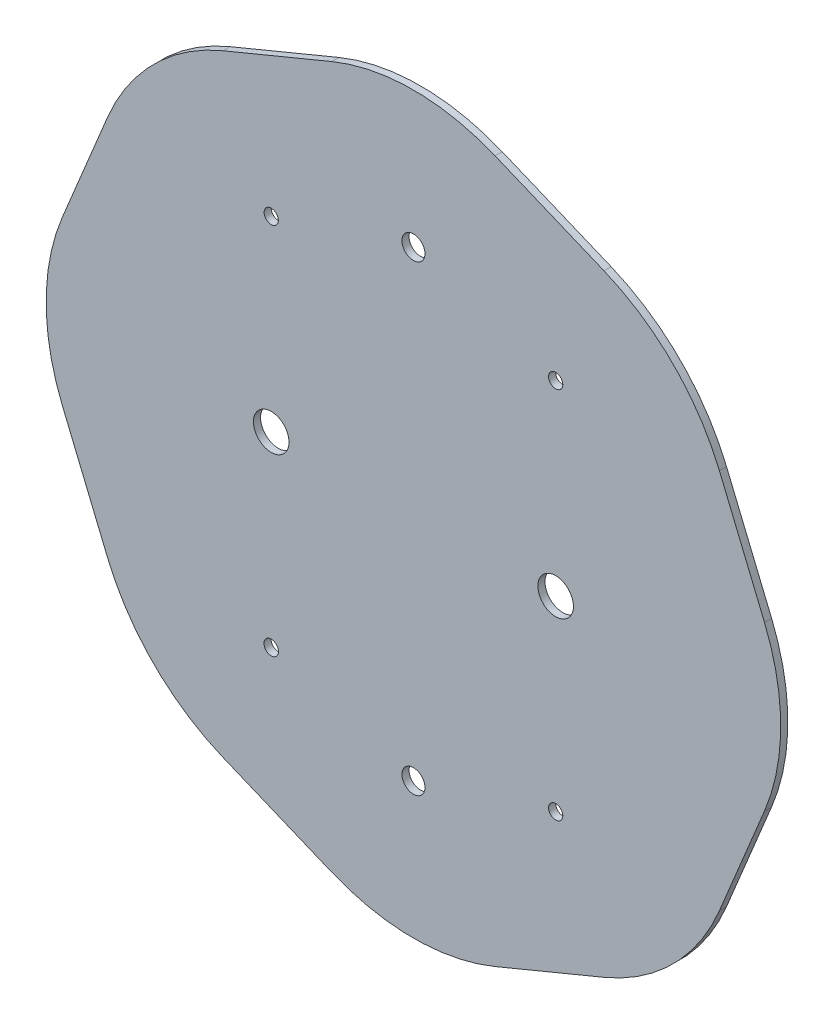
ISO-10303-21;
HEADER;
FILE_DESCRIPTION(('STEP AP214'),'2;1');
FILE_NAME('part.step','',(''),(''),'','','');
FILE_SCHEMA(('AUTOMOTIVE_DESIGN { 1 0 10303 214 1 1 1 1 }'));
ENDSEC;
DATA;
#1=APPLICATION_CONTEXT('core data for automotive mechanical design processes');
#2=APPLICATION_PROTOCOL_DEFINITION('international standard','automotive_design',2000,#1);
#3=PRODUCT_CONTEXT('',#1,'mechanical');
#4=PRODUCT('Part','Part','',(#3));
#5=PRODUCT_RELATED_PRODUCT_CATEGORY('part','',(#4));
#6=PRODUCT_DEFINITION_FORMATION('','',#4);
#7=PRODUCT_DEFINITION_CONTEXT('part definition',#1,'design');
#8=PRODUCT_DEFINITION('design','',#6,#7);
#9=PRODUCT_DEFINITION_SHAPE('','',#8);
#10=(LENGTH_UNIT() NAMED_UNIT(*) SI_UNIT(.MILLI.,.METRE.));
#11=(NAMED_UNIT(*) PLANE_ANGLE_UNIT() SI_UNIT($,.RADIAN.));
#12=(NAMED_UNIT(*) SI_UNIT($,.STERADIAN.) SOLID_ANGLE_UNIT());
#13=UNCERTAINTY_MEASURE_WITH_UNIT(LENGTH_MEASURE(1.E-05),#10,'distance_accuracy_value','');
#14=(GEOMETRIC_REPRESENTATION_CONTEXT(3) GLOBAL_UNCERTAINTY_ASSIGNED_CONTEXT((#13)) GLOBAL_UNIT_ASSIGNED_CONTEXT((#10,
#11,#12)) REPRESENTATION_CONTEXT('',''));
#15=CARTESIAN_POINT('',(0.,0.,0.));
#16=DIRECTION('',(0.,0.,1.));
#17=DIRECTION('',(1.,0.,0.));
#18=AXIS2_PLACEMENT_3D('',#15,#16,#17);
#19=CARTESIAN_POINT('',(-3.06146745892072,3.06146745892071,0.2));
#20=DIRECTION('',(0.,0.,1.));
#21=DIRECTION('',(1.,0.,0.));
#22=AXIS2_PLACEMENT_3D('',#19,#20,#21);
#23=PLANE('',#22);
#24=CARTESIAN_POINT('',(4.,-5.25,0.2));
#25=DIRECTION('',(0.,0.,-1.));
#26=DIRECTION('',(-1.,0.,0.));
#27=AXIS2_PLACEMENT_3D('',#24,#25,#26);
#28=CIRCLE('',#27,0.2);
#29=CARTESIAN_POINT('',(3.8,-5.25,0.2));
#30=VERTEX_POINT('',#29);
#31=EDGE_CURVE('E351',#30,#30,#28,.T.);
#32=ORIENTED_EDGE('',*,*,#31,.T.);
#33=EDGE_LOOP('',(#32));
#34=FACE_BOUND('',#33,.T.);
#35=CARTESIAN_POINT('',(0.,-6.5,0.2));
#36=DIRECTION('',(0.,0.,-1.));
#37=DIRECTION('',(-1.,0.,0.));
#38=AXIS2_PLACEMENT_3D('',#35,#36,#37);
#39=CIRCLE('',#38,0.323929716117766);
#40=CARTESIAN_POINT('',(-0.323929716117766,-6.5,0.2));
#41=VERTEX_POINT('',#40);
#42=EDGE_CURVE('E355',#41,#41,#39,.T.);
#43=ORIENTED_EDGE('',*,*,#42,.T.);
#44=EDGE_LOOP('',(#43));
#45=FACE_BOUND('',#44,.T.);
#46=CARTESIAN_POINT('',(-4.,-5.25,0.2));
#47=DIRECTION('',(0.,0.,-1.));
#48=DIRECTION('',(-1.,0.,0.));
#49=AXIS2_PLACEMENT_3D('',#46,#47,#48);
#50=CIRCLE('',#49,0.203589936638274);
#51=CARTESIAN_POINT('',(-4.20358993663827,-5.25,0.2));
#52=VERTEX_POINT('',#51);
#53=EDGE_CURVE('E363',#52,#52,#50,.T.);
#54=ORIENTED_EDGE('',*,*,#53,.T.);
#55=EDGE_LOOP('',(#54));
#56=FACE_BOUND('',#55,.T.);
#57=CARTESIAN_POINT('',(-4.,0.,0.2));
#58=DIRECTION('',(0.,0.,-1.));
#59=DIRECTION('',(-1.,0.,0.));
#60=AXIS2_PLACEMENT_3D('',#57,#58,#59);
#61=CIRCLE('',#60,0.5);
#62=CARTESIAN_POINT('',(-4.5,0.,0.2));
#63=VERTEX_POINT('',#62);
#64=EDGE_CURVE('E368',#63,#63,#61,.T.);
#65=ORIENTED_EDGE('',*,*,#64,.T.);
#66=EDGE_LOOP('',(#65));
#67=FACE_BOUND('',#66,.T.);
#68=CARTESIAN_POINT('',(-3.06146745892072,3.06146745892071,0.2));
#69=DIRECTION('',(0.,0.,1.));
#70=DIRECTION('',(1.,0.,0.));
#71=AXIS2_PLACEMENT_3D('',#68,#69,#70);
#72=CIRCLE('',#71,6.);
#73=CARTESIAN_POINT('',(-5.35756805311127,8.60474465398843,0.2));
#74=VERTEX_POINT('',#73);
#75=CARTESIAN_POINT('',(-8.60474465398844,5.35756805311124,0.2));
#76=VERTEX_POINT('',#75);
#77=EDGE_CURVE('E210',#74,#76,#72,.T.);
#78=ORIENTED_EDGE('',*,*,#77,.T.);
#79=DIRECTION('',(-0.382683432365088,-0.923879532511287,0.));
#80=VECTOR('',#79,1.);
#81=CARTESIAN_POINT('',(-8.60474465398844,5.35756805311124,0.2));
#82=LINE('',#81,#80);
#83=CARTESIAN_POINT('',(-9.8728459962373,2.29610059419052,0.2));
#84=VERTEX_POINT('',#83);
#85=EDGE_CURVE('E118',#76,#84,#82,.T.);
#86=ORIENTED_EDGE('',*,*,#85,.T.);
#87=CARTESIAN_POINT('',(-4.32956880116957,0.,0.2));
#88=DIRECTION('',(0.,0.,1.));
#89=DIRECTION('',(1.,0.,0.));
#90=AXIS2_PLACEMENT_3D('',#87,#88,#89);
#91=CIRCLE('',#90,6.);
#92=CARTESIAN_POINT('',(-9.87284599623729,-2.29610059419055,0.2));
#93=VERTEX_POINT('',#92);
#94=EDGE_CURVE('E249',#84,#93,#91,.T.);
#95=ORIENTED_EDGE('',*,*,#94,.T.);
#96=DIRECTION('',(0.38268343236509,-0.923879532511286,0.));
#97=VECTOR('',#96,1.);
#98=CARTESIAN_POINT('',(-9.87284599623729,-2.29610059419055,0.2));
#99=LINE('',#98,#97);
#100=CARTESIAN_POINT('',(-8.60474465398843,-5.35756805311127,0.2));
#101=VERTEX_POINT('',#100);
#102=EDGE_CURVE('E268',#93,#101,#99,.T.);
#103=ORIENTED_EDGE('',*,*,#102,.T.);
#104=CARTESIAN_POINT('',(-3.06146745892071,-3.06146745892072,0.2));
#105=DIRECTION('',(0.,0.,1.));
#106=DIRECTION('',(1.,0.,0.));
#107=AXIS2_PLACEMENT_3D('',#104,#105,#106);
#108=CIRCLE('',#107,6.);
#109=CARTESIAN_POINT('',(-5.35756805311124,-8.60474465398845,0.2));
#110=VERTEX_POINT('',#109);
#111=EDGE_CURVE('E265',#101,#110,#108,.T.);
#112=ORIENTED_EDGE('',*,*,#111,.T.);
#113=DIRECTION('',(0.923879532511287,-0.382683432365088,0.));
#114=VECTOR('',#113,1.);
#115=CARTESIAN_POINT('',(-5.35756805311124,-8.60474465398845,0.2));
#116=LINE('',#115,#114);
#117=CARTESIAN_POINT('',(-2.29610059419053,-9.8728459962373,0.2));
#118=VERTEX_POINT('',#117);
#119=EDGE_CURVE('E267',#110,#118,#116,.T.);
#120=ORIENTED_EDGE('',*,*,#119,.T.);
#121=CARTESIAN_POINT('',(0.,-4.32956880116957,0.2));
#122=DIRECTION('',(0.,0.,1.));
#123=DIRECTION('',(1.,0.,0.));
#124=AXIS2_PLACEMENT_3D('',#121,#122,#123);
#125=CIRCLE('',#124,6.);
#126=CARTESIAN_POINT('',(2.29610059419055,-9.87284599623729,0.2));
#127=VERTEX_POINT('',#126);
#128=EDGE_CURVE('E270',#118,#127,#125,.T.);
#129=ORIENTED_EDGE('',*,*,#128,.T.);
#130=DIRECTION('',(0.923879532511287,0.38268343236509,0.));
#131=VECTOR('',#130,1.);
#132=CARTESIAN_POINT('',(2.29610059419055,-9.87284599623729,0.2));
#133=LINE('',#132,#131);
#134=CARTESIAN_POINT('',(5.35756805311126,-8.60474465398843,0.2));
#135=VERTEX_POINT('',#134);
#136=EDGE_CURVE('E276',#127,#135,#133,.T.);
#137=ORIENTED_EDGE('',*,*,#136,.T.);
#138=CARTESIAN_POINT('',(3.06146745892072,-3.06146745892071,0.2));
#139=DIRECTION('',(0.,0.,1.));
#140=DIRECTION('',(1.,0.,0.));
#141=AXIS2_PLACEMENT_3D('',#138,#139,#140);
#142=CIRCLE('',#141,6.);
#143=CARTESIAN_POINT('',(8.60474465398844,-5.35756805311125,0.2));
#144=VERTEX_POINT('',#143);
#145=EDGE_CURVE('E278',#135,#144,#142,.T.);
#146=ORIENTED_EDGE('',*,*,#145,.T.);
#147=DIRECTION('',(0.382683432365088,0.923879532511288,0.));
#148=VECTOR('',#147,1.);
#149=CARTESIAN_POINT('',(8.60474465398844,-5.35756805311125,0.2));
#150=LINE('',#149,#148);
#151=CARTESIAN_POINT('',(9.8728459962373,-2.29610059419053,0.2));
#152=VERTEX_POINT('',#151);
#153=EDGE_CURVE('E280',#144,#152,#150,.T.);
#154=ORIENTED_EDGE('',*,*,#153,.T.);
#155=CARTESIAN_POINT('',(4.32956880116958,0.,0.2));
#156=DIRECTION('',(0.,0.,1.));
#157=DIRECTION('',(1.,0.,0.));
#158=AXIS2_PLACEMENT_3D('',#155,#156,#157);
#159=CIRCLE('',#158,6.);
#160=CARTESIAN_POINT('',(9.87284599623729,2.29610059419055,0.2));
#161=VERTEX_POINT('',#160);
#162=EDGE_CURVE('E282',#152,#161,#159,.T.);
#163=ORIENTED_EDGE('',*,*,#162,.T.);
#164=DIRECTION('',(-0.382683432365091,0.923879532511286,0.));
#165=VECTOR('',#164,1.);
#166=CARTESIAN_POINT('',(9.87284599623729,2.29610059419055,0.2));
#167=LINE('',#166,#165);
#168=CARTESIAN_POINT('',(8.60474465398843,5.35756805311126,0.2));
#169=VERTEX_POINT('',#168);
#170=EDGE_CURVE('E284',#161,#169,#167,.T.);
#171=ORIENTED_EDGE('',*,*,#170,.T.);
#172=CARTESIAN_POINT('',(3.06146745892072,3.06146745892072,0.2));
#173=DIRECTION('',(0.,0.,1.));
#174=DIRECTION('',(1.,0.,0.));
#175=AXIS2_PLACEMENT_3D('',#172,#173,#174);
#176=CIRCLE('',#175,6.);
#177=CARTESIAN_POINT('',(5.35756805311125,8.60474465398844,0.2));
#178=VERTEX_POINT('',#177);
#179=EDGE_CURVE('E161',#169,#178,#176,.T.);
#180=ORIENTED_EDGE('',*,*,#179,.T.);
#181=DIRECTION('',(-0.923879532511287,0.382683432365088,0.));
#182=VECTOR('',#181,1.);
#183=CARTESIAN_POINT('',(5.35756805311125,8.60474465398844,0.2));
#184=LINE('',#183,#182);
#185=CARTESIAN_POINT('',(2.29610059419052,9.8728459962373,0.2));
#186=VERTEX_POINT('',#185);
#187=EDGE_CURVE('E155',#178,#186,#184,.T.);
#188=ORIENTED_EDGE('',*,*,#187,.T.);
#189=CARTESIAN_POINT('',(0.,4.32956880116957,0.2));
#190=DIRECTION('',(0.,0.,1.));
#191=DIRECTION('',(-1.,0.,0.));
#192=AXIS2_PLACEMENT_3D('',#189,#190,#191);
#193=CIRCLE('',#192,6.);
#194=CARTESIAN_POINT('',(-2.29610059419055,9.87284599623729,0.2));
#195=VERTEX_POINT('',#194);
#196=EDGE_CURVE('E159',#186,#195,#193,.T.);
#197=ORIENTED_EDGE('',*,*,#196,.T.);
#198=DIRECTION('',(-0.923879532511287,-0.38268343236509,0.));
#199=VECTOR('',#198,1.);
#200=CARTESIAN_POINT('',(-2.29610059419055,9.87284599623729,0.2));
#201=LINE('',#200,#199);
#202=EDGE_CURVE('E51',#195,#74,#201,.T.);
#203=ORIENTED_EDGE('',*,*,#202,.T.);
#204=EDGE_LOOP('',(#78,#86,#95,#103,#112,#120,#129,#137,#146,#154,#163,#171,#180,#188,#197,#203));
#205=FACE_BOUND('',#204,.T.);
#206=CARTESIAN_POINT('',(-4.,5.25,0.2));
#207=DIRECTION('',(0.,0.,-1.));
#208=DIRECTION('',(-1.,0.,0.));
#209=AXIS2_PLACEMENT_3D('',#206,#207,#208);
#210=CIRCLE('',#209,0.200000000000001);
#211=CARTESIAN_POINT('',(-4.2,5.25,0.2));
#212=VERTEX_POINT('',#211);
#213=EDGE_CURVE('E183',#212,#212,#210,.T.);
#214=ORIENTED_EDGE('',*,*,#213,.T.);
#215=EDGE_LOOP('',(#214));
#216=FACE_BOUND('',#215,.T.);
#217=CARTESIAN_POINT('',(0.,6.5,0.2));
#218=DIRECTION('',(0.,0.,-1.));
#219=DIRECTION('',(-1.,0.,0.));
#220=AXIS2_PLACEMENT_3D('',#217,#218,#219);
#221=CIRCLE('',#220,0.323929716117766);
#222=CARTESIAN_POINT('',(-0.323929716117766,6.5,0.2));
#223=VERTEX_POINT('',#222);
#224=EDGE_CURVE('E386',#223,#223,#221,.T.);
#225=ORIENTED_EDGE('',*,*,#224,.T.);
#226=EDGE_LOOP('',(#225));
#227=FACE_BOUND('',#226,.T.);
#228=CARTESIAN_POINT('',(4.,5.25,0.2));
#229=DIRECTION('',(0.,0.,-1.));
#230=DIRECTION('',(-1.,0.,0.));
#231=AXIS2_PLACEMENT_3D('',#228,#229,#230);
#232=CIRCLE('',#231,0.200000000000001);
#233=CARTESIAN_POINT('',(3.8,5.25,0.2));
#234=VERTEX_POINT('',#233);
#235=EDGE_CURVE('E380',#234,#234,#232,.T.);
#236=ORIENTED_EDGE('',*,*,#235,.T.);
#237=EDGE_LOOP('',(#236));
#238=FACE_BOUND('',#237,.T.);
#239=CARTESIAN_POINT('',(4.,0.,0.2));
#240=DIRECTION('',(0.,0.,1.));
#241=DIRECTION('',(1.,0.,0.));
#242=AXIS2_PLACEMENT_3D('',#239,#240,#241);
#243=CIRCLE('',#242,0.5);
#244=CARTESIAN_POINT('',(4.5,0.,0.2));
#245=VERTEX_POINT('',#244);
#246=EDGE_CURVE('E374',#245,#245,#243,.T.);
#247=ORIENTED_EDGE('',*,*,#246,.F.);
#248=EDGE_LOOP('',(#247));
#249=FACE_BOUND('',#248,.T.);
#250=ADVANCED_FACE('F34',(#34,#45,#56,#67,#205,#216,#227,#238,#249),#23,.T.);
#251=CARTESIAN_POINT('',(-3.06146745892072,3.06146745892071,0.));
#252=DIRECTION('',(0.,0.,1.));
#253=DIRECTION('',(1.,0.,0.));
#254=AXIS2_PLACEMENT_3D('',#251,#252,#253);
#255=PLANE('',#254);
#256=CARTESIAN_POINT('',(4.,-5.25,0.));
#257=DIRECTION('',(0.,0.,-1.));
#258=DIRECTION('',(-1.,0.,0.));
#259=AXIS2_PLACEMENT_3D('',#256,#257,#258);
#260=CIRCLE('',#259,0.2);
#261=CARTESIAN_POINT('',(3.8,-5.25,0.));
#262=VERTEX_POINT('',#261);
#263=EDGE_CURVE('E354',#262,#262,#260,.T.);
#264=ORIENTED_EDGE('',*,*,#263,.F.);
#265=EDGE_LOOP('',(#264));
#266=FACE_BOUND('',#265,.T.);
#267=CARTESIAN_POINT('',(0.,-6.5,0.));
#268=DIRECTION('',(0.,0.,-1.));
#269=DIRECTION('',(-1.,0.,0.));
#270=AXIS2_PLACEMENT_3D('',#267,#268,#269);
#271=CIRCLE('',#270,0.323929716117766);
#272=CARTESIAN_POINT('',(-0.323929716117766,-6.5,0.));
#273=VERTEX_POINT('',#272);
#274=EDGE_CURVE('E358',#273,#273,#271,.T.);
#275=ORIENTED_EDGE('',*,*,#274,.F.);
#276=EDGE_LOOP('',(#275));
#277=FACE_BOUND('',#276,.T.);
#278=CARTESIAN_POINT('',(-4.,-5.25,0.));
#279=DIRECTION('',(0.,0.,-1.));
#280=DIRECTION('',(-1.,0.,0.));
#281=AXIS2_PLACEMENT_3D('',#278,#279,#280);
#282=CIRCLE('',#281,0.203589936638274);
#283=CARTESIAN_POINT('',(-4.20358993663827,-5.25,0.));
#284=VERTEX_POINT('',#283);
#285=EDGE_CURVE('E365',#284,#284,#282,.T.);
#286=ORIENTED_EDGE('',*,*,#285,.F.);
#287=EDGE_LOOP('',(#286));
#288=FACE_BOUND('',#287,.T.);
#289=CARTESIAN_POINT('',(-4.,0.,0.));
#290=DIRECTION('',(0.,0.,-1.));
#291=DIRECTION('',(-1.,0.,0.));
#292=AXIS2_PLACEMENT_3D('',#289,#290,#291);
#293=CIRCLE('',#292,0.5);
#294=CARTESIAN_POINT('',(-4.5,0.,0.));
#295=VERTEX_POINT('',#294);
#296=EDGE_CURVE('E371',#295,#295,#293,.T.);
#297=ORIENTED_EDGE('',*,*,#296,.F.);
#298=EDGE_LOOP('',(#297));
#299=FACE_BOUND('',#298,.T.);
#300=CARTESIAN_POINT('',(-3.06146745892072,3.06146745892071,0.));
#301=DIRECTION('',(0.,0.,1.));
#302=DIRECTION('',(1.,0.,0.));
#303=AXIS2_PLACEMENT_3D('',#300,#301,#302);
#304=CIRCLE('',#303,6.);
#305=CARTESIAN_POINT('',(-5.35756805311127,8.60474465398843,0.));
#306=VERTEX_POINT('',#305);
#307=CARTESIAN_POINT('',(-8.60474465398844,5.35756805311124,0.));
#308=VERTEX_POINT('',#307);
#309=EDGE_CURVE('E179',#306,#308,#304,.T.);
#310=ORIENTED_EDGE('',*,*,#309,.F.);
#311=DIRECTION('',(-0.923879532511287,-0.38268343236509,0.));
#312=VECTOR('',#311,1.);
#313=CARTESIAN_POINT('',(-2.29610059419055,9.87284599623729,0.));
#314=LINE('',#313,#312);
#315=CARTESIAN_POINT('',(-2.29610059419055,9.87284599623729,0.));
#316=VERTEX_POINT('',#315);
#317=EDGE_CURVE('E110',#316,#306,#314,.T.);
#318=ORIENTED_EDGE('',*,*,#317,.F.);
#319=CARTESIAN_POINT('',(0.,4.32956880116957,0.));
#320=DIRECTION('',(0.,0.,1.));
#321=DIRECTION('',(-1.,0.,0.));
#322=AXIS2_PLACEMENT_3D('',#319,#320,#321);
#323=CIRCLE('',#322,6.);
#324=CARTESIAN_POINT('',(2.29610059419052,9.8728459962373,0.));
#325=VERTEX_POINT('',#324);
#326=EDGE_CURVE('E104',#325,#316,#323,.T.);
#327=ORIENTED_EDGE('',*,*,#326,.F.);
#328=DIRECTION('',(-0.923879532511287,0.382683432365088,0.));
#329=VECTOR('',#328,1.);
#330=CARTESIAN_POINT('',(5.35756805311125,8.60474465398844,0.));
#331=LINE('',#330,#329);
#332=CARTESIAN_POINT('',(5.35756805311125,8.60474465398844,0.));
#333=VERTEX_POINT('',#332);
#334=EDGE_CURVE('E169',#333,#325,#331,.T.);
#335=ORIENTED_EDGE('',*,*,#334,.F.);
#336=CARTESIAN_POINT('',(3.06146745892072,3.06146745892072,0.));
#337=DIRECTION('',(0.,0.,1.));
#338=DIRECTION('',(1.,0.,0.));
#339=AXIS2_PLACEMENT_3D('',#336,#337,#338);
#340=CIRCLE('',#339,6.);
#341=CARTESIAN_POINT('',(8.60474465398843,5.35756805311126,0.));
#342=VERTEX_POINT('',#341);
#343=EDGE_CURVE('E205',#342,#333,#340,.T.);
#344=ORIENTED_EDGE('',*,*,#343,.F.);
#345=DIRECTION('',(-0.382683432365091,0.923879532511286,0.));
#346=VECTOR('',#345,1.);
#347=CARTESIAN_POINT('',(9.87284599623729,2.29610059419055,0.));
#348=LINE('',#347,#346);
#349=CARTESIAN_POINT('',(9.87284599623729,2.29610059419055,0.));
#350=VERTEX_POINT('',#349);
#351=EDGE_CURVE('E203',#350,#342,#348,.T.);
#352=ORIENTED_EDGE('',*,*,#351,.F.);
#353=CARTESIAN_POINT('',(4.32956880116958,0.,0.));
#354=DIRECTION('',(0.,0.,1.));
#355=DIRECTION('',(1.,0.,0.));
#356=AXIS2_PLACEMENT_3D('',#353,#354,#355);
#357=CIRCLE('',#356,6.);
#358=CARTESIAN_POINT('',(9.8728459962373,-2.29610059419053,0.));
#359=VERTEX_POINT('',#358);
#360=EDGE_CURVE('E201',#359,#350,#357,.T.);
#361=ORIENTED_EDGE('',*,*,#360,.F.);
#362=DIRECTION('',(0.382683432365088,0.923879532511288,0.));
#363=VECTOR('',#362,1.);
#364=CARTESIAN_POINT('',(8.60474465398844,-5.35756805311125,0.));
#365=LINE('',#364,#363);
#366=CARTESIAN_POINT('',(8.60474465398844,-5.35756805311125,0.));
#367=VERTEX_POINT('',#366);
#368=EDGE_CURVE('E199',#367,#359,#365,.T.);
#369=ORIENTED_EDGE('',*,*,#368,.F.);
#370=CARTESIAN_POINT('',(3.06146745892072,-3.06146745892071,0.));
#371=DIRECTION('',(0.,0.,1.));
#372=DIRECTION('',(1.,0.,0.));
#373=AXIS2_PLACEMENT_3D('',#370,#371,#372);
#374=CIRCLE('',#373,6.);
#375=CARTESIAN_POINT('',(5.35756805311126,-8.60474465398843,0.));
#376=VERTEX_POINT('',#375);
#377=EDGE_CURVE('E197',#376,#367,#374,.T.);
#378=ORIENTED_EDGE('',*,*,#377,.F.);
#379=DIRECTION('',(0.923879532511287,0.38268343236509,0.));
#380=VECTOR('',#379,1.);
#381=CARTESIAN_POINT('',(2.29610059419055,-9.87284599623729,0.));
#382=LINE('',#381,#380);
#383=CARTESIAN_POINT('',(2.29610059419055,-9.87284599623729,0.));
#384=VERTEX_POINT('',#383);
#385=EDGE_CURVE('E195',#384,#376,#382,.T.);
#386=ORIENTED_EDGE('',*,*,#385,.F.);
#387=CARTESIAN_POINT('',(0.,-4.32956880116957,0.));
#388=DIRECTION('',(0.,0.,1.));
#389=DIRECTION('',(1.,0.,0.));
#390=AXIS2_PLACEMENT_3D('',#387,#388,#389);
#391=CIRCLE('',#390,6.);
#392=CARTESIAN_POINT('',(-2.29610059419053,-9.8728459962373,0.));
#393=VERTEX_POINT('',#392);
#394=EDGE_CURVE('E193',#393,#384,#391,.T.);
#395=ORIENTED_EDGE('',*,*,#394,.F.);
#396=DIRECTION('',(0.923879532511287,-0.382683432365088,0.));
#397=VECTOR('',#396,1.);
#398=CARTESIAN_POINT('',(-5.35756805311124,-8.60474465398845,0.));
#399=LINE('',#398,#397);
#400=CARTESIAN_POINT('',(-5.35756805311124,-8.60474465398845,0.));
#401=VERTEX_POINT('',#400);
#402=EDGE_CURVE('E191',#401,#393,#399,.T.);
#403=ORIENTED_EDGE('',*,*,#402,.F.);
#404=CARTESIAN_POINT('',(-3.06146745892071,-3.06146745892072,0.));
#405=DIRECTION('',(0.,0.,1.));
#406=DIRECTION('',(1.,0.,0.));
#407=AXIS2_PLACEMENT_3D('',#404,#405,#406);
#408=CIRCLE('',#407,6.);
#409=CARTESIAN_POINT('',(-8.60474465398843,-5.35756805311127,0.));
#410=VERTEX_POINT('',#409);
#411=EDGE_CURVE('E189',#410,#401,#408,.T.);
#412=ORIENTED_EDGE('',*,*,#411,.F.);
#413=DIRECTION('',(0.38268343236509,-0.923879532511286,0.));
#414=VECTOR('',#413,1.);
#415=CARTESIAN_POINT('',(-9.87284599623729,-2.29610059419055,0.));
#416=LINE('',#415,#414);
#417=CARTESIAN_POINT('',(-9.87284599623729,-2.29610059419055,0.));
#418=VERTEX_POINT('',#417);
#419=EDGE_CURVE('E187',#418,#410,#416,.T.);
#420=ORIENTED_EDGE('',*,*,#419,.F.);
#421=CARTESIAN_POINT('',(-4.32956880116957,0.,0.));
#422=DIRECTION('',(0.,0.,1.));
#423=DIRECTION('',(1.,0.,0.));
#424=AXIS2_PLACEMENT_3D('',#421,#422,#423);
#425=CIRCLE('',#424,6.);
#426=CARTESIAN_POINT('',(-9.8728459962373,2.29610059419052,0.));
#427=VERTEX_POINT('',#426);
#428=EDGE_CURVE('E185',#427,#418,#425,.T.);
#429=ORIENTED_EDGE('',*,*,#428,.F.);
#430=DIRECTION('',(-0.382683432365088,-0.923879532511287,0.));
#431=VECTOR('',#430,1.);
#432=CARTESIAN_POINT('',(-8.60474465398844,5.35756805311124,0.));
#433=LINE('',#432,#431);
#434=EDGE_CURVE('E182',#308,#427,#433,.T.);
#435=ORIENTED_EDGE('',*,*,#434,.F.);
#436=EDGE_LOOP('',(#310,#318,#327,#335,#344,#352,#361,#369,#378,#386,#395,#403,#412,#420,#429,#435));
#437=FACE_BOUND('',#436,.T.);
#438=CARTESIAN_POINT('',(-4.,5.25,0.));
#439=DIRECTION('',(0.,0.,-1.));
#440=DIRECTION('',(-1.,0.,0.));
#441=AXIS2_PLACEMENT_3D('',#438,#439,#440);
#442=CIRCLE('',#441,0.200000000000001);
#443=CARTESIAN_POINT('',(-4.2,5.25,0.));
#444=VERTEX_POINT('',#443);
#445=EDGE_CURVE('E392',#444,#444,#442,.T.);
#446=ORIENTED_EDGE('',*,*,#445,.F.);
#447=EDGE_LOOP('',(#446));
#448=FACE_BOUND('',#447,.T.);
#449=CARTESIAN_POINT('',(0.,6.5,0.));
#450=DIRECTION('',(0.,0.,-1.));
#451=DIRECTION('',(-1.,0.,0.));
#452=AXIS2_PLACEMENT_3D('',#449,#450,#451);
#453=CIRCLE('',#452,0.323929716117766);
#454=CARTESIAN_POINT('',(-0.323929716117766,6.5,0.));
#455=VERTEX_POINT('',#454);
#456=EDGE_CURVE('E389',#455,#455,#453,.T.);
#457=ORIENTED_EDGE('',*,*,#456,.F.);
#458=EDGE_LOOP('',(#457));
#459=FACE_BOUND('',#458,.T.);
#460=CARTESIAN_POINT('',(4.,5.25,0.));
#461=DIRECTION('',(0.,0.,-1.));
#462=DIRECTION('',(-1.,0.,0.));
#463=AXIS2_PLACEMENT_3D('',#460,#461,#462);
#464=CIRCLE('',#463,0.200000000000001);
#465=CARTESIAN_POINT('',(3.8,5.25,0.));
#466=VERTEX_POINT('',#465);
#467=EDGE_CURVE('E383',#466,#466,#464,.T.);
#468=ORIENTED_EDGE('',*,*,#467,.F.);
#469=EDGE_LOOP('',(#468));
#470=FACE_BOUND('',#469,.T.);
#471=CARTESIAN_POINT('',(4.,0.,0.));
#472=DIRECTION('',(0.,0.,1.));
#473=DIRECTION('',(1.,0.,0.));
#474=AXIS2_PLACEMENT_3D('',#471,#472,#473);
#475=CIRCLE('',#474,0.5);
#476=CARTESIAN_POINT('',(4.5,0.,0.));
#477=VERTEX_POINT('',#476);
#478=EDGE_CURVE('E377',#477,#477,#475,.T.);
#479=ORIENTED_EDGE('',*,*,#478,.T.);
#480=EDGE_LOOP('',(#479));
#481=FACE_BOUND('',#480,.T.);
#482=ADVANCED_FACE('F253',(#266,#277,#288,#299,#437,#448,#459,#470,#481),#255,.F.);
#483=CARTESIAN_POINT('',(-3.06146745892072,3.06146745892071,0.2));
#484=DIRECTION('',(0.,0.,-1.));
#485=DIRECTION('',(-1.,0.,0.));
#486=AXIS2_PLACEMENT_3D('',#483,#484,#485);
#487=CYLINDRICAL_SURFACE('',#486,6.);
#488=ORIENTED_EDGE('',*,*,#309,.T.);
#489=DIRECTION('',(0.,0.,-1.));
#490=VECTOR('',#489,1.);
#491=CARTESIAN_POINT('',(-8.60474465398844,5.35756805311124,0.2));
#492=LINE('',#491,#490);
#493=EDGE_CURVE('E11',#76,#308,#492,.T.);
#494=ORIENTED_EDGE('',*,*,#493,.F.);
#495=ORIENTED_EDGE('',*,*,#77,.F.);
#496=DIRECTION('',(0.,0.,-1.));
#497=VECTOR('',#496,1.);
#498=CARTESIAN_POINT('',(-5.35756805311127,8.60474465398843,0.2));
#499=LINE('',#498,#497);
#500=EDGE_CURVE('E175',#74,#306,#499,.T.);
#501=ORIENTED_EDGE('',*,*,#500,.T.);
#502=EDGE_LOOP('',(#488,#494,#495,#501));
#503=FACE_BOUND('',#502,.T.);
#504=ADVANCED_FACE('F36',(#503),#487,.T.);
#505=CARTESIAN_POINT('',(-8.60474465398844,5.35756805311124,0.2));
#506=DIRECTION('',(0.923879532511287,-0.382683432365088,0.));
#507=DIRECTION('',(0.382683432365088,0.923879532511287,0.));
#508=AXIS2_PLACEMENT_3D('',#505,#506,#507);
#509=PLANE('',#508);
#510=ORIENTED_EDGE('',*,*,#434,.T.);
#511=DIRECTION('',(0.,0.,-1.));
#512=VECTOR('',#511,1.);
#513=CARTESIAN_POINT('',(-9.8728459962373,2.29610059419052,0.2));
#514=LINE('',#513,#512);
#515=EDGE_CURVE('E43',#84,#427,#514,.T.);
#516=ORIENTED_EDGE('',*,*,#515,.F.);
#517=ORIENTED_EDGE('',*,*,#85,.F.);
#518=ORIENTED_EDGE('',*,*,#493,.T.);
#519=EDGE_LOOP('',(#510,#516,#517,#518));
#520=FACE_BOUND('',#519,.T.);
#521=ADVANCED_FACE('F590',(#520),#509,.F.);
#522=CARTESIAN_POINT('',(-4.32956880116957,0.,0.2));
#523=DIRECTION('',(0.,0.,-1.));
#524=DIRECTION('',(-1.,0.,0.));
#525=AXIS2_PLACEMENT_3D('',#522,#523,#524);
#526=CYLINDRICAL_SURFACE('',#525,6.);
#527=ORIENTED_EDGE('',*,*,#428,.T.);
#528=DIRECTION('',(0.,0.,-1.));
#529=VECTOR('',#528,1.);
#530=CARTESIAN_POINT('',(-9.87284599623729,-2.29610059419055,0.2));
#531=LINE('',#530,#529);
#532=EDGE_CURVE('E241',#93,#418,#531,.T.);
#533=ORIENTED_EDGE('',*,*,#532,.F.);
#534=ORIENTED_EDGE('',*,*,#94,.F.);
#535=ORIENTED_EDGE('',*,*,#515,.T.);
#536=EDGE_LOOP('',(#527,#533,#534,#535));
#537=FACE_BOUND('',#536,.T.);
#538=ADVANCED_FACE('F247',(#537),#526,.T.);
#539=CARTESIAN_POINT('',(-9.87284599623729,-2.29610059419055,0.2));
#540=DIRECTION('',(0.923879532511287,0.38268343236509,0.));
#541=DIRECTION('',(-0.38268343236509,0.923879532511287,0.));
#542=AXIS2_PLACEMENT_3D('',#539,#540,#541);
#543=PLANE('',#542);
#544=ORIENTED_EDGE('',*,*,#419,.T.);
#545=DIRECTION('',(0.,0.,-1.));
#546=VECTOR('',#545,1.);
#547=CARTESIAN_POINT('',(-8.60474465398843,-5.35756805311127,0.2));
#548=LINE('',#547,#546);
#549=EDGE_CURVE('E238',#101,#410,#548,.T.);
#550=ORIENTED_EDGE('',*,*,#549,.F.);
#551=ORIENTED_EDGE('',*,*,#102,.F.);
#552=ORIENTED_EDGE('',*,*,#532,.T.);
#553=EDGE_LOOP('',(#544,#550,#551,#552));
#554=FACE_BOUND('',#553,.T.);
#555=ADVANCED_FACE('F259',(#554),#543,.F.);
#556=CARTESIAN_POINT('',(-3.06146745892071,-3.06146745892072,0.2));
#557=DIRECTION('',(0.,0.,-1.));
#558=DIRECTION('',(-1.,0.,0.));
#559=AXIS2_PLACEMENT_3D('',#556,#557,#558);
#560=CYLINDRICAL_SURFACE('',#559,6.);
#561=ORIENTED_EDGE('',*,*,#411,.T.);
#562=DIRECTION('',(0.,0.,-1.));
#563=VECTOR('',#562,1.);
#564=CARTESIAN_POINT('',(-5.35756805311124,-8.60474465398845,0.2));
#565=LINE('',#564,#563);
#566=EDGE_CURVE('E235',#110,#401,#565,.T.);
#567=ORIENTED_EDGE('',*,*,#566,.F.);
#568=ORIENTED_EDGE('',*,*,#111,.F.);
#569=ORIENTED_EDGE('',*,*,#549,.T.);
#570=EDGE_LOOP('',(#561,#567,#568,#569));
#571=FACE_BOUND('',#570,.T.);
#572=ADVANCED_FACE('F263',(#571),#560,.T.);
#573=CARTESIAN_POINT('',(-5.35756805311124,-8.60474465398845,0.2));
#574=DIRECTION('',(0.382683432365088,0.923879532511287,0.));
#575=DIRECTION('',(-0.923879532511287,0.382683432365088,0.));
#576=AXIS2_PLACEMENT_3D('',#573,#574,#575);
#577=PLANE('',#576);
#578=ORIENTED_EDGE('',*,*,#402,.T.);
#579=DIRECTION('',(0.,0.,-1.));
#580=VECTOR('',#579,1.);
#581=CARTESIAN_POINT('',(-2.29610059419053,-9.8728459962373,0.2));
#582=LINE('',#581,#580);
#583=EDGE_CURVE('E232',#118,#393,#582,.T.);
#584=ORIENTED_EDGE('',*,*,#583,.F.);
#585=ORIENTED_EDGE('',*,*,#119,.F.);
#586=ORIENTED_EDGE('',*,*,#566,.T.);
#587=EDGE_LOOP('',(#578,#584,#585,#586));
#588=FACE_BOUND('',#587,.T.);
#589=ADVANCED_FACE('F555',(#588),#577,.F.);
#590=CARTESIAN_POINT('',(0.,-4.32956880116957,0.2));
#591=DIRECTION('',(0.,0.,-1.));
#592=DIRECTION('',(-1.,0.,0.));
#593=AXIS2_PLACEMENT_3D('',#590,#591,#592);
#594=CYLINDRICAL_SURFACE('',#593,6.);
#595=ORIENTED_EDGE('',*,*,#394,.T.);
#596=DIRECTION('',(0.,0.,-1.));
#597=VECTOR('',#596,1.);
#598=CARTESIAN_POINT('',(2.29610059419055,-9.87284599623729,0.2));
#599=LINE('',#598,#597);
#600=EDGE_CURVE('E229',#127,#384,#599,.T.);
#601=ORIENTED_EDGE('',*,*,#600,.F.);
#602=ORIENTED_EDGE('',*,*,#128,.F.);
#603=ORIENTED_EDGE('',*,*,#583,.T.);
#604=EDGE_LOOP('',(#595,#601,#602,#603));
#605=FACE_BOUND('',#604,.T.);
#606=ADVANCED_FACE('F545',(#605),#594,.T.);
#607=CARTESIAN_POINT('',(2.29610059419055,-9.87284599623729,0.2));
#608=DIRECTION('',(-0.38268343236509,0.923879532511287,0.));
#609=DIRECTION('',(-0.923879532511287,-0.38268343236509,0.));
#610=AXIS2_PLACEMENT_3D('',#607,#608,#609);
#611=PLANE('',#610);
#612=ORIENTED_EDGE('',*,*,#385,.T.);
#613=DIRECTION('',(0.,0.,-1.));
#614=VECTOR('',#613,1.);
#615=CARTESIAN_POINT('',(5.35756805311126,-8.60474465398843,0.2));
#616=LINE('',#615,#614);
#617=EDGE_CURVE('E226',#135,#376,#616,.T.);
#618=ORIENTED_EDGE('',*,*,#617,.F.);
#619=ORIENTED_EDGE('',*,*,#136,.F.);
#620=ORIENTED_EDGE('',*,*,#600,.T.);
#621=EDGE_LOOP('',(#612,#618,#619,#620));
#622=FACE_BOUND('',#621,.T.);
#623=ADVANCED_FACE('F535',(#622),#611,.F.);
#624=CARTESIAN_POINT('',(3.06146745892072,-3.06146745892071,0.2));
#625=DIRECTION('',(0.,0.,-1.));
#626=DIRECTION('',(-1.,0.,0.));
#627=AXIS2_PLACEMENT_3D('',#624,#625,#626);
#628=CYLINDRICAL_SURFACE('',#627,6.);
#629=ORIENTED_EDGE('',*,*,#377,.T.);
#630=DIRECTION('',(0.,0.,-1.));
#631=VECTOR('',#630,1.);
#632=CARTESIAN_POINT('',(8.60474465398844,-5.35756805311125,0.2));
#633=LINE('',#632,#631);
#634=EDGE_CURVE('E223',#144,#367,#633,.T.);
#635=ORIENTED_EDGE('',*,*,#634,.F.);
#636=ORIENTED_EDGE('',*,*,#145,.F.);
#637=ORIENTED_EDGE('',*,*,#617,.T.);
#638=EDGE_LOOP('',(#629,#635,#636,#637));
#639=FACE_BOUND('',#638,.T.);
#640=ADVANCED_FACE('F525',(#639),#628,.T.);
#641=CARTESIAN_POINT('',(8.60474465398844,-5.35756805311125,0.2));
#642=DIRECTION('',(-0.923879532511288,0.382683432365088,0.));
#643=DIRECTION('',(-0.382683432365088,-0.923879532511288,0.));
#644=AXIS2_PLACEMENT_3D('',#641,#642,#643);
#645=PLANE('',#644);
#646=ORIENTED_EDGE('',*,*,#368,.T.);
#647=DIRECTION('',(0.,0.,-1.));
#648=VECTOR('',#647,1.);
#649=CARTESIAN_POINT('',(9.8728459962373,-2.29610059419053,0.2));
#650=LINE('',#649,#648);
#651=EDGE_CURVE('E220',#152,#359,#650,.T.);
#652=ORIENTED_EDGE('',*,*,#651,.F.);
#653=ORIENTED_EDGE('',*,*,#153,.F.);
#654=ORIENTED_EDGE('',*,*,#634,.T.);
#655=EDGE_LOOP('',(#646,#652,#653,#654));
#656=FACE_BOUND('',#655,.T.);
#657=ADVANCED_FACE('F515',(#656),#645,.F.);
#658=CARTESIAN_POINT('',(4.32956880116958,0.,0.2));
#659=DIRECTION('',(0.,0.,-1.));
#660=DIRECTION('',(-1.,0.,0.));
#661=AXIS2_PLACEMENT_3D('',#658,#659,#660);
#662=CYLINDRICAL_SURFACE('',#661,6.);
#663=ORIENTED_EDGE('',*,*,#360,.T.);
#664=DIRECTION('',(0.,0.,-1.));
#665=VECTOR('',#664,1.);
#666=CARTESIAN_POINT('',(9.87284599623729,2.29610059419055,0.2));
#667=LINE('',#666,#665);
#668=EDGE_CURVE('E217',#161,#350,#667,.T.);
#669=ORIENTED_EDGE('',*,*,#668,.F.);
#670=ORIENTED_EDGE('',*,*,#162,.F.);
#671=ORIENTED_EDGE('',*,*,#651,.T.);
#672=EDGE_LOOP('',(#663,#669,#670,#671));
#673=FACE_BOUND('',#672,.T.);
#674=ADVANCED_FACE('F506',(#673),#662,.T.);
#675=CARTESIAN_POINT('',(9.87284599623729,2.29610059419055,0.2));
#676=DIRECTION('',(-0.923879532511286,-0.382683432365091,0.));
#677=DIRECTION('',(0.382683432365091,-0.923879532511286,0.));
#678=AXIS2_PLACEMENT_3D('',#675,#676,#677);
#679=PLANE('',#678);
#680=ORIENTED_EDGE('',*,*,#351,.T.);
#681=DIRECTION('',(0.,0.,-1.));
#682=VECTOR('',#681,1.);
#683=CARTESIAN_POINT('',(8.60474465398843,5.35756805311126,0.2));
#684=LINE('',#683,#682);
#685=EDGE_CURVE('E214',#169,#342,#684,.T.);
#686=ORIENTED_EDGE('',*,*,#685,.F.);
#687=ORIENTED_EDGE('',*,*,#170,.F.);
#688=ORIENTED_EDGE('',*,*,#668,.T.);
#689=EDGE_LOOP('',(#680,#686,#687,#688));
#690=FACE_BOUND('',#689,.T.);
#691=ADVANCED_FACE('F290',(#690),#679,.F.);
#692=CARTESIAN_POINT('',(3.06146745892072,3.06146745892072,0.2));
#693=DIRECTION('',(0.,0.,-1.));
#694=DIRECTION('',(-1.,0.,0.));
#695=AXIS2_PLACEMENT_3D('',#692,#693,#694);
#696=CYLINDRICAL_SURFACE('',#695,6.);
#697=ORIENTED_EDGE('',*,*,#343,.T.);
#698=DIRECTION('',(0.,0.,-1.));
#699=VECTOR('',#698,1.);
#700=CARTESIAN_POINT('',(5.35756805311125,8.60474465398844,0.2));
#701=LINE('',#700,#699);
#702=EDGE_CURVE('E170',#178,#333,#701,.T.);
#703=ORIENTED_EDGE('',*,*,#702,.F.);
#704=ORIENTED_EDGE('',*,*,#179,.F.);
#705=ORIENTED_EDGE('',*,*,#685,.T.);
#706=EDGE_LOOP('',(#697,#703,#704,#705));
#707=FACE_BOUND('',#706,.T.);
#708=ADVANCED_FACE('F294',(#707),#696,.T.);
#709=CARTESIAN_POINT('',(5.35756805311125,8.60474465398844,0.2));
#710=DIRECTION('',(-0.382683432365089,-0.923879532511287,0.));
#711=DIRECTION('',(0.923879532511287,-0.382683432365089,0.));
#712=AXIS2_PLACEMENT_3D('',#709,#710,#711);
#713=PLANE('',#712);
#714=ORIENTED_EDGE('',*,*,#334,.T.);
#715=DIRECTION('',(0.,0.,-1.));
#716=VECTOR('',#715,1.);
#717=CARTESIAN_POINT('',(2.29610059419052,9.8728459962373,0.2));
#718=LINE('',#717,#716);
#719=EDGE_CURVE('E166',#186,#325,#718,.T.);
#720=ORIENTED_EDGE('',*,*,#719,.F.);
#721=ORIENTED_EDGE('',*,*,#187,.F.);
#722=ORIENTED_EDGE('',*,*,#702,.T.);
#723=EDGE_LOOP('',(#714,#720,#721,#722));
#724=FACE_BOUND('',#723,.T.);
#725=ADVANCED_FACE('F167',(#724),#713,.F.);
#726=CARTESIAN_POINT('',(0.,4.32956880116957,0.2));
#727=DIRECTION('',(0.,0.,-1.));
#728=DIRECTION('',(-1.,0.,0.));
#729=AXIS2_PLACEMENT_3D('',#726,#727,#728);
#730=CYLINDRICAL_SURFACE('',#729,6.);
#731=ORIENTED_EDGE('',*,*,#326,.T.);
#732=DIRECTION('',(0.,0.,-1.));
#733=VECTOR('',#732,1.);
#734=CARTESIAN_POINT('',(-2.29610059419055,9.87284599623729,0.2));
#735=LINE('',#734,#733);
#736=EDGE_CURVE('E171',#195,#316,#735,.T.);
#737=ORIENTED_EDGE('',*,*,#736,.F.);
#738=ORIENTED_EDGE('',*,*,#196,.F.);
#739=ORIENTED_EDGE('',*,*,#719,.T.);
#740=EDGE_LOOP('',(#731,#737,#738,#739));
#741=FACE_BOUND('',#740,.T.);
#742=ADVANCED_FACE('F173',(#741),#730,.T.);
#743=CARTESIAN_POINT('',(-2.29610059419055,9.87284599623729,0.2));
#744=DIRECTION('',(0.38268343236509,-0.923879532511287,0.));
#745=DIRECTION('',(0.923879532511287,0.38268343236509,0.));
#746=AXIS2_PLACEMENT_3D('',#743,#744,#745);
#747=PLANE('',#746);
#748=ORIENTED_EDGE('',*,*,#317,.T.);
#749=ORIENTED_EDGE('',*,*,#500,.F.);
#750=ORIENTED_EDGE('',*,*,#202,.F.);
#751=ORIENTED_EDGE('',*,*,#736,.T.);
#752=EDGE_LOOP('',(#748,#749,#750,#751));
#753=FACE_BOUND('',#752,.T.);
#754=ADVANCED_FACE('F298',(#753),#747,.F.);
#755=CARTESIAN_POINT('',(-4.,5.25,0.2));
#756=DIRECTION('',(0.,0.,-1.));
#757=DIRECTION('',(-1.,0.,0.));
#758=AXIS2_PLACEMENT_3D('',#755,#756,#757);
#759=CYLINDRICAL_SURFACE('',#758,0.200000000000001);
#760=ORIENTED_EDGE('',*,*,#213,.F.);
#761=EDGE_LOOP('',(#760));
#762=FACE_BOUND('',#761,.T.);
#763=ORIENTED_EDGE('',*,*,#445,.T.);
#764=EDGE_LOOP('',(#763));
#765=FACE_BOUND('',#764,.T.);
#766=ADVANCED_FACE('F300',(#762,#765),#759,.F.);
#767=CARTESIAN_POINT('',(0.,6.5,0.2));
#768=DIRECTION('',(0.,0.,-1.));
#769=DIRECTION('',(-1.,0.,0.));
#770=AXIS2_PLACEMENT_3D('',#767,#768,#769);
#771=CYLINDRICAL_SURFACE('',#770,0.323929716117766);
#772=ORIENTED_EDGE('',*,*,#224,.F.);
#773=EDGE_LOOP('',(#772));
#774=FACE_BOUND('',#773,.T.);
#775=ORIENTED_EDGE('',*,*,#456,.T.);
#776=EDGE_LOOP('',(#775));
#777=FACE_BOUND('',#776,.T.);
#778=ADVANCED_FACE('F306',(#774,#777),#771,.F.);
#779=CARTESIAN_POINT('',(4.,5.25,0.2));
#780=DIRECTION('',(0.,0.,-1.));
#781=DIRECTION('',(-1.,0.,0.));
#782=AXIS2_PLACEMENT_3D('',#779,#780,#781);
#783=CYLINDRICAL_SURFACE('',#782,0.200000000000001);
#784=ORIENTED_EDGE('',*,*,#235,.F.);
#785=EDGE_LOOP('',(#784));
#786=FACE_BOUND('',#785,.T.);
#787=ORIENTED_EDGE('',*,*,#467,.T.);
#788=EDGE_LOOP('',(#787));
#789=FACE_BOUND('',#788,.T.);
#790=ADVANCED_FACE('F323',(#786,#789),#783,.F.);
#791=CARTESIAN_POINT('',(4.,0.,0.2));
#792=DIRECTION('',(0.,0.,-1.));
#793=DIRECTION('',(-1.,0.,0.));
#794=AXIS2_PLACEMENT_3D('',#791,#792,#793);
#795=CYLINDRICAL_SURFACE('',#794,0.5);
#796=ORIENTED_EDGE('',*,*,#246,.T.);
#797=EDGE_LOOP('',(#796));
#798=FACE_BOUND('',#797,.T.);
#799=ORIENTED_EDGE('',*,*,#478,.F.);
#800=EDGE_LOOP('',(#799));
#801=FACE_BOUND('',#800,.T.);
#802=ADVANCED_FACE('F327',(#798,#801),#795,.F.);
#803=CARTESIAN_POINT('',(-4.,0.,0.2));
#804=DIRECTION('',(0.,0.,-1.));
#805=DIRECTION('',(-1.,0.,0.));
#806=AXIS2_PLACEMENT_3D('',#803,#804,#805);
#807=CYLINDRICAL_SURFACE('',#806,0.5);
#808=ORIENTED_EDGE('',*,*,#64,.F.);
#809=EDGE_LOOP('',(#808));
#810=FACE_BOUND('',#809,.T.);
#811=ORIENTED_EDGE('',*,*,#296,.T.);
#812=EDGE_LOOP('',(#811));
#813=FACE_BOUND('',#812,.T.);
#814=ADVANCED_FACE('F331',(#810,#813),#807,.F.);
#815=CARTESIAN_POINT('',(-4.,-5.25,0.2));
#816=DIRECTION('',(0.,0.,-1.));
#817=DIRECTION('',(-1.,0.,0.));
#818=AXIS2_PLACEMENT_3D('',#815,#816,#817);
#819=CYLINDRICAL_SURFACE('',#818,0.203589936638274);
#820=ORIENTED_EDGE('',*,*,#53,.F.);
#821=EDGE_LOOP('',(#820));
#822=FACE_BOUND('',#821,.T.);
#823=ORIENTED_EDGE('',*,*,#285,.T.);
#824=EDGE_LOOP('',(#823));
#825=FACE_BOUND('',#824,.T.);
#826=ADVANCED_FACE('F335',(#822,#825),#819,.F.);
#827=CARTESIAN_POINT('',(0.,-6.5,0.2));
#828=DIRECTION('',(0.,0.,-1.));
#829=DIRECTION('',(-1.,0.,0.));
#830=AXIS2_PLACEMENT_3D('',#827,#828,#829);
#831=CYLINDRICAL_SURFACE('',#830,0.323929716117766);
#832=ORIENTED_EDGE('',*,*,#42,.F.);
#833=EDGE_LOOP('',(#832));
#834=FACE_BOUND('',#833,.T.);
#835=ORIENTED_EDGE('',*,*,#274,.T.);
#836=EDGE_LOOP('',(#835));
#837=FACE_BOUND('',#836,.T.);
#838=ADVANCED_FACE('F339',(#834,#837),#831,.F.);
#839=CARTESIAN_POINT('',(4.,-5.25,0.2));
#840=DIRECTION('',(0.,0.,-1.));
#841=DIRECTION('',(-1.,0.,0.));
#842=AXIS2_PLACEMENT_3D('',#839,#840,#841);
#843=CYLINDRICAL_SURFACE('',#842,0.2);
#844=ORIENTED_EDGE('',*,*,#31,.F.);
#845=EDGE_LOOP('',(#844));
#846=FACE_BOUND('',#845,.T.);
#847=ORIENTED_EDGE('',*,*,#263,.T.);
#848=EDGE_LOOP('',(#847));
#849=FACE_BOUND('',#848,.T.);
#850=ADVANCED_FACE('F343',(#846,#849),#843,.F.);
#851=CLOSED_SHELL('',(#250,#482,#504,#521,#538,#555,#572,#589,#606,#623,#640,#657,#674,#691,
#708,#725,#742,#754,#766,#778,#790,#802,#814,#826,#838,#850));
#852=MANIFOLD_SOLID_BREP('B2',#851);
#853=ADVANCED_BREP_SHAPE_REPRESENTATION('',(#18,#852),#14);
#854=SHAPE_DEFINITION_REPRESENTATION(#9,#853);
ENDSEC;
END-ISO-10303-21;
